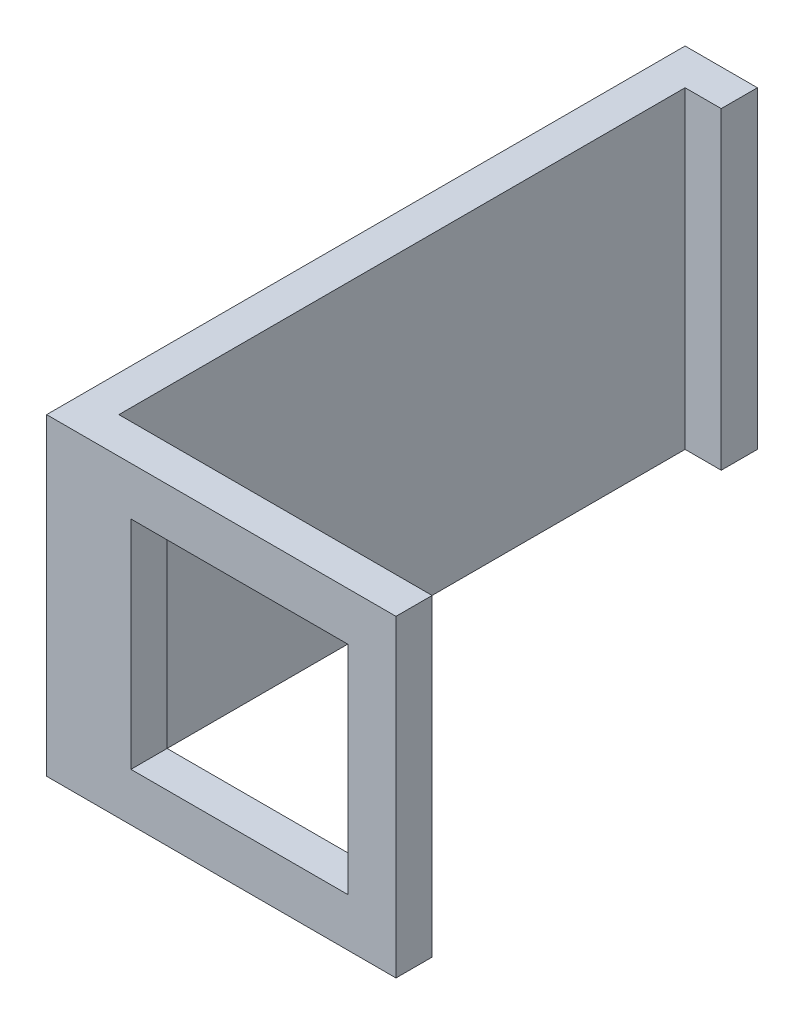
ISO-10303-21;
HEADER;
FILE_DESCRIPTION(('STEP AP214'),'2;1');
FILE_NAME('part.step','',(''),(''),'','','');
FILE_SCHEMA(('AUTOMOTIVE_DESIGN { 1 0 10303 214 1 1 1 1 }'));
ENDSEC;
DATA;
#1=APPLICATION_CONTEXT('core data for automotive mechanical design processes');
#2=APPLICATION_PROTOCOL_DEFINITION('international standard','automotive_design',2000,#1);
#3=PRODUCT_CONTEXT('',#1,'mechanical');
#4=PRODUCT('Part','Part','',(#3));
#5=PRODUCT_RELATED_PRODUCT_CATEGORY('part','',(#4));
#6=PRODUCT_DEFINITION_FORMATION('','',#4);
#7=PRODUCT_DEFINITION_CONTEXT('part definition',#1,'design');
#8=PRODUCT_DEFINITION('design','',#6,#7);
#9=PRODUCT_DEFINITION_SHAPE('','',#8);
#10=(LENGTH_UNIT() NAMED_UNIT(*) SI_UNIT(.MILLI.,.METRE.));
#11=(NAMED_UNIT(*) PLANE_ANGLE_UNIT() SI_UNIT($,.RADIAN.));
#12=(NAMED_UNIT(*) SI_UNIT($,.STERADIAN.) SOLID_ANGLE_UNIT());
#13=UNCERTAINTY_MEASURE_WITH_UNIT(LENGTH_MEASURE(1.E-05),#10,'distance_accuracy_value','');
#14=(GEOMETRIC_REPRESENTATION_CONTEXT(3) GLOBAL_UNCERTAINTY_ASSIGNED_CONTEXT((#13)) GLOBAL_UNIT_ASSIGNED_CONTEXT((#10,
#11,#12)) REPRESENTATION_CONTEXT('',''));
#15=CARTESIAN_POINT('',(0.,0.,0.));
#16=DIRECTION('',(0.,0.,1.));
#17=DIRECTION('',(1.,0.,0.));
#18=AXIS2_PLACEMENT_3D('',#15,#16,#17);
#19=CARTESIAN_POINT('',(-5.75,6.5,-25.));
#20=DIRECTION('',(-1.,0.,0.));
#21=DIRECTION('',(0.,-1.,0.));
#22=AXIS2_PLACEMENT_3D('',#19,#20,#21);
#23=PLANE('',#22);
#24=DIRECTION('',(0.,-1.,0.));
#25=VECTOR('',#24,1.);
#26=CARTESIAN_POINT('',(-5.75,-6.5,-23.5));
#27=LINE('',#26,#25);
#28=CARTESIAN_POINT('',(-5.75,6.5,-23.5));
#29=VERTEX_POINT('',#28);
#30=CARTESIAN_POINT('',(-5.75,-6.5,-23.5));
#31=VERTEX_POINT('',#30);
#32=EDGE_CURVE('E151',#29,#31,#27,.T.);
#33=ORIENTED_EDGE('',*,*,#32,.F.);
#34=DIRECTION('',(0.,0.,1.));
#35=VECTOR('',#34,1.);
#36=CARTESIAN_POINT('',(-5.75,6.5,-25.));
#37=LINE('',#36,#35);
#38=CARTESIAN_POINT('',(-5.74999999999999,6.5,0.));
#39=VERTEX_POINT('',#38);
#40=EDGE_CURVE('E37',#29,#39,#37,.T.);
#41=ORIENTED_EDGE('',*,*,#40,.T.);
#42=DIRECTION('',(0.,-1.,0.));
#43=VECTOR('',#42,1.);
#44=CARTESIAN_POINT('',(-5.75,6.5,0.));
#45=LINE('',#44,#43);
#46=CARTESIAN_POINT('',(-5.75,-6.5,0.));
#47=VERTEX_POINT('',#46);
#48=EDGE_CURVE('E161',#39,#47,#45,.T.);
#49=ORIENTED_EDGE('',*,*,#48,.T.);
#50=DIRECTION('',(0.,0.,1.));
#51=VECTOR('',#50,1.);
#52=CARTESIAN_POINT('',(-5.75,-6.5,-25.));
#53=LINE('',#52,#51);
#54=EDGE_CURVE('E164',#31,#47,#53,.T.);
#55=ORIENTED_EDGE('',*,*,#54,.F.);
#56=EDGE_LOOP('',(#33,#41,#49,#55));
#57=FACE_BOUND('',#56,.T.);
#58=ADVANCED_FACE('F33',(#57),#23,.F.);
#59=CARTESIAN_POINT('',(0.,0.,0.));
#60=DIRECTION('',(0.,0.,1.));
#61=DIRECTION('',(1.,0.,0.));
#62=AXIS2_PLACEMENT_3D('',#59,#60,#61);
#63=PLANE('',#62);
#64=DIRECTION('',(0.,1.,0.));
#65=VECTOR('',#64,1.);
#66=CARTESIAN_POINT('',(5.25,-4.5,0.));
#67=LINE('',#66,#65);
#68=CARTESIAN_POINT('',(5.25,-4.5,0.));
#69=VERTEX_POINT('',#68);
#70=CARTESIAN_POINT('',(5.25,4.5,0.));
#71=VERTEX_POINT('',#70);
#72=EDGE_CURVE('E180',#69,#71,#67,.T.);
#73=ORIENTED_EDGE('',*,*,#72,.T.);
#74=DIRECTION('',(-1.,0.,0.));
#75=VECTOR('',#74,1.);
#76=CARTESIAN_POINT('',(5.25,4.5,0.));
#77=LINE('',#76,#75);
#78=CARTESIAN_POINT('',(-3.75,4.5,0.));
#79=VERTEX_POINT('',#78);
#80=EDGE_CURVE('E182',#71,#79,#77,.T.);
#81=ORIENTED_EDGE('',*,*,#80,.T.);
#82=DIRECTION('',(0.,-1.,0.));
#83=VECTOR('',#82,1.);
#84=CARTESIAN_POINT('',(-3.75,-4.5,0.));
#85=LINE('',#84,#83);
#86=CARTESIAN_POINT('',(-3.75,-4.5,0.));
#87=VERTEX_POINT('',#86);
#88=EDGE_CURVE('E187',#79,#87,#85,.T.);
#89=ORIENTED_EDGE('',*,*,#88,.T.);
#90=DIRECTION('',(1.,0.,0.));
#91=VECTOR('',#90,1.);
#92=CARTESIAN_POINT('',(5.25,-4.5,0.));
#93=LINE('',#92,#91);
#94=EDGE_CURVE('E195',#87,#69,#93,.T.);
#95=ORIENTED_EDGE('',*,*,#94,.T.);
#96=EDGE_LOOP('',(#73,#81,#89,#95));
#97=FACE_BOUND('',#96,.T.);
#98=ORIENTED_EDGE('',*,*,#48,.F.);
#99=DIRECTION('',(-1.,0.,0.));
#100=VECTOR('',#99,1.);
#101=CARTESIAN_POINT('',(7.25,6.5,0.));
#102=LINE('',#101,#100);
#103=CARTESIAN_POINT('',(7.25,6.5,0.));
#104=VERTEX_POINT('',#103);
#105=EDGE_CURVE('E210',#104,#39,#102,.T.);
#106=ORIENTED_EDGE('',*,*,#105,.F.);
#107=DIRECTION('',(0.,1.,0.));
#108=VECTOR('',#107,1.);
#109=CARTESIAN_POINT('',(7.25,-6.5,0.));
#110=LINE('',#109,#108);
#111=CARTESIAN_POINT('',(7.25,-6.5,0.));
#112=VERTEX_POINT('',#111);
#113=EDGE_CURVE('E218',#112,#104,#110,.T.);
#114=ORIENTED_EDGE('',*,*,#113,.F.);
#115=DIRECTION('',(1.,0.,0.));
#116=VECTOR('',#115,1.);
#117=CARTESIAN_POINT('',(7.25,-6.5,0.));
#118=LINE('',#117,#116);
#119=EDGE_CURVE('E172',#47,#112,#118,.T.);
#120=ORIENTED_EDGE('',*,*,#119,.F.);
#121=EDGE_LOOP('',(#98,#106,#114,#120));
#122=FACE_BOUND('',#121,.T.);
#123=ADVANCED_FACE('F242',(#97,#122),#63,.F.);
#124=CARTESIAN_POINT('',(0.,0.,1.5));
#125=DIRECTION('',(0.,0.,1.));
#126=DIRECTION('',(1.,0.,0.));
#127=AXIS2_PLACEMENT_3D('',#124,#125,#126);
#128=PLANE('',#127);
#129=DIRECTION('',(0.,-1.,0.));
#130=VECTOR('',#129,1.);
#131=CARTESIAN_POINT('',(-7.25,-6.5,1.5));
#132=LINE('',#131,#130);
#133=CARTESIAN_POINT('',(-7.25,6.5,1.5));
#134=VERTEX_POINT('',#133);
#135=CARTESIAN_POINT('',(-7.25,-6.5,1.5));
#136=VERTEX_POINT('',#135);
#137=EDGE_CURVE('E206',#134,#136,#132,.T.);
#138=ORIENTED_EDGE('',*,*,#137,.T.);
#139=DIRECTION('',(1.,0.,0.));
#140=VECTOR('',#139,1.);
#141=CARTESIAN_POINT('',(7.25,-6.5,1.5));
#142=LINE('',#141,#140);
#143=CARTESIAN_POINT('',(7.25,-6.5,1.5));
#144=VERTEX_POINT('',#143);
#145=EDGE_CURVE('E209',#136,#144,#142,.T.);
#146=ORIENTED_EDGE('',*,*,#145,.T.);
#147=DIRECTION('',(0.,1.,0.));
#148=VECTOR('',#147,1.);
#149=CARTESIAN_POINT('',(7.25,-6.5,1.5));
#150=LINE('',#149,#148);
#151=CARTESIAN_POINT('',(7.25,6.5,1.5));
#152=VERTEX_POINT('',#151);
#153=EDGE_CURVE('E212',#144,#152,#150,.T.);
#154=ORIENTED_EDGE('',*,*,#153,.T.);
#155=DIRECTION('',(-1.,0.,0.));
#156=VECTOR('',#155,1.);
#157=CARTESIAN_POINT('',(7.25,6.5,1.5));
#158=LINE('',#157,#156);
#159=EDGE_CURVE('E214',#152,#134,#158,.T.);
#160=ORIENTED_EDGE('',*,*,#159,.T.);
#161=EDGE_LOOP('',(#138,#146,#154,#160));
#162=FACE_BOUND('',#161,.T.);
#163=DIRECTION('',(-1.,0.,0.));
#164=VECTOR('',#163,1.);
#165=CARTESIAN_POINT('',(5.25,4.5,1.5));
#166=LINE('',#165,#164);
#167=CARTESIAN_POINT('',(5.25,4.5,1.5));
#168=VERTEX_POINT('',#167);
#169=CARTESIAN_POINT('',(-3.75,4.5,1.5));
#170=VERTEX_POINT('',#169);
#171=EDGE_CURVE('E391',#168,#170,#166,.T.);
#172=ORIENTED_EDGE('',*,*,#171,.F.);
#173=DIRECTION('',(0.,1.,0.));
#174=VECTOR('',#173,1.);
#175=CARTESIAN_POINT('',(5.25,-4.5,1.5));
#176=LINE('',#175,#174);
#177=CARTESIAN_POINT('',(5.25,-4.5,1.5));
#178=VERTEX_POINT('',#177);
#179=EDGE_CURVE('E167',#178,#168,#176,.T.);
#180=ORIENTED_EDGE('',*,*,#179,.F.);
#181=DIRECTION('',(1.,0.,0.));
#182=VECTOR('',#181,1.);
#183=CARTESIAN_POINT('',(5.25,-4.5,1.5));
#184=LINE('',#183,#182);
#185=CARTESIAN_POINT('',(-3.75,-4.5,1.5));
#186=VERTEX_POINT('',#185);
#187=EDGE_CURVE('E190',#186,#178,#184,.T.);
#188=ORIENTED_EDGE('',*,*,#187,.F.);
#189=DIRECTION('',(0.,-1.,0.));
#190=VECTOR('',#189,1.);
#191=CARTESIAN_POINT('',(-3.75,-4.5,1.5));
#192=LINE('',#191,#190);
#193=EDGE_CURVE('E389',#170,#186,#192,.T.);
#194=ORIENTED_EDGE('',*,*,#193,.F.);
#195=EDGE_LOOP('',(#172,#180,#188,#194));
#196=FACE_BOUND('',#195,.T.);
#197=ADVANCED_FACE('F234',(#162,#196),#128,.T.);
#198=CARTESIAN_POINT('',(-7.25,-6.5,1.5));
#199=DIRECTION('',(1.,0.,0.));
#200=DIRECTION('',(0.,0.,-1.));
#201=AXIS2_PLACEMENT_3D('',#198,#199,#200);
#202=PLANE('',#201);
#203=DIRECTION('',(0.,0.,-1.));
#204=VECTOR('',#203,1.);
#205=CARTESIAN_POINT('',(-7.25,6.5,1.5));
#206=LINE('',#205,#204);
#207=CARTESIAN_POINT('',(-7.25,6.5,-25.));
#208=VERTEX_POINT('',#207);
#209=EDGE_CURVE('E215',#134,#208,#206,.T.);
#210=ORIENTED_EDGE('',*,*,#209,.T.);
#211=DIRECTION('',(0.,1.,0.));
#212=VECTOR('',#211,1.);
#213=CARTESIAN_POINT('',(-7.25,6.5,-25.));
#214=LINE('',#213,#212);
#215=CARTESIAN_POINT('',(-7.25,-6.5,-25.));
#216=VERTEX_POINT('',#215);
#217=EDGE_CURVE('E133',#216,#208,#214,.T.);
#218=ORIENTED_EDGE('',*,*,#217,.F.);
#219=DIRECTION('',(0.,0.,-1.));
#220=VECTOR('',#219,1.);
#221=CARTESIAN_POINT('',(-7.25,-6.5,1.5));
#222=LINE('',#221,#220);
#223=EDGE_CURVE('E11',#136,#216,#222,.T.);
#224=ORIENTED_EDGE('',*,*,#223,.F.);
#225=ORIENTED_EDGE('',*,*,#137,.F.);
#226=EDGE_LOOP('',(#210,#218,#224,#225));
#227=FACE_BOUND('',#226,.T.);
#228=ADVANCED_FACE('F35',(#227),#202,.F.);
#229=CARTESIAN_POINT('',(7.25,-6.5,1.5));
#230=DIRECTION('',(0.,1.,0.));
#231=DIRECTION('',(-1.,0.,0.));
#232=AXIS2_PLACEMENT_3D('',#229,#230,#231);
#233=PLANE('',#232);
#234=ORIENTED_EDGE('',*,*,#223,.T.);
#235=DIRECTION('',(-1.,0.,0.));
#236=VECTOR('',#235,1.);
#237=CARTESIAN_POINT('',(-5.75,-6.5,-25.));
#238=LINE('',#237,#236);
#239=CARTESIAN_POINT('',(-4.25,-6.5,-25.));
#240=VERTEX_POINT('',#239);
#241=EDGE_CURVE('E136',#240,#216,#238,.T.);
#242=ORIENTED_EDGE('',*,*,#241,.F.);
#243=DIRECTION('',(0.,0.,-1.));
#244=VECTOR('',#243,1.);
#245=CARTESIAN_POINT('',(-4.25,-6.5,-23.5));
#246=LINE('',#245,#244);
#247=CARTESIAN_POINT('',(-4.25,-6.5,-23.5));
#248=VERTEX_POINT('',#247);
#249=EDGE_CURVE('E150',#248,#240,#246,.T.);
#250=ORIENTED_EDGE('',*,*,#249,.F.);
#251=DIRECTION('',(-1.,0.,0.));
#252=VECTOR('',#251,1.);
#253=CARTESIAN_POINT('',(-4.25,-6.5,-23.5));
#254=LINE('',#253,#252);
#255=EDGE_CURVE('E156',#248,#31,#254,.T.);
#256=ORIENTED_EDGE('',*,*,#255,.T.);
#257=ORIENTED_EDGE('',*,*,#54,.T.);
#258=ORIENTED_EDGE('',*,*,#119,.T.);
#259=DIRECTION('',(0.,0.,-1.));
#260=VECTOR('',#259,1.);
#261=CARTESIAN_POINT('',(7.25,-6.5,1.5));
#262=LINE('',#261,#260);
#263=EDGE_CURVE('E43',#144,#112,#262,.T.);
#264=ORIENTED_EDGE('',*,*,#263,.F.);
#265=ORIENTED_EDGE('',*,*,#145,.F.);
#266=EDGE_LOOP('',(#234,#242,#250,#256,#257,#258,#264,#265));
#267=FACE_BOUND('',#266,.T.);
#268=ADVANCED_FACE('F246',(#267),#233,.F.);
#269=CARTESIAN_POINT('',(7.25,-6.5,1.5));
#270=DIRECTION('',(-1.,0.,0.));
#271=DIRECTION('',(0.,0.,1.));
#272=AXIS2_PLACEMENT_3D('',#269,#270,#271);
#273=PLANE('',#272);
#274=ORIENTED_EDGE('',*,*,#113,.T.);
#275=DIRECTION('',(0.,0.,-1.));
#276=VECTOR('',#275,1.);
#277=CARTESIAN_POINT('',(7.25,6.5,1.5));
#278=LINE('',#277,#276);
#279=EDGE_CURVE('E225',#152,#104,#278,.T.);
#280=ORIENTED_EDGE('',*,*,#279,.F.);
#281=ORIENTED_EDGE('',*,*,#153,.F.);
#282=ORIENTED_EDGE('',*,*,#263,.T.);
#283=EDGE_LOOP('',(#274,#280,#281,#282));
#284=FACE_BOUND('',#283,.T.);
#285=ADVANCED_FACE('F239',(#284),#273,.F.);
#286=CARTESIAN_POINT('',(7.25,6.5,1.5));
#287=DIRECTION('',(0.,-1.,0.));
#288=DIRECTION('',(1.,0.,0.));
#289=AXIS2_PLACEMENT_3D('',#286,#287,#288);
#290=PLANE('',#289);
#291=ORIENTED_EDGE('',*,*,#105,.T.);
#292=ORIENTED_EDGE('',*,*,#40,.F.);
#293=DIRECTION('',(-1.,0.,0.));
#294=VECTOR('',#293,1.);
#295=CARTESIAN_POINT('',(-4.25,6.5,-23.5));
#296=LINE('',#295,#294);
#297=CARTESIAN_POINT('',(-4.25,6.5,-23.5));
#298=VERTEX_POINT('',#297);
#299=EDGE_CURVE('E142',#298,#29,#296,.T.);
#300=ORIENTED_EDGE('',*,*,#299,.F.);
#301=DIRECTION('',(0.,0.,1.));
#302=VECTOR('',#301,1.);
#303=CARTESIAN_POINT('',(-4.25,6.5,-23.5));
#304=LINE('',#303,#302);
#305=CARTESIAN_POINT('',(-4.25,6.5,-25.));
#306=VERTEX_POINT('',#305);
#307=EDGE_CURVE('E139',#306,#298,#304,.T.);
#308=ORIENTED_EDGE('',*,*,#307,.F.);
#309=DIRECTION('',(1.,0.,0.));
#310=VECTOR('',#309,1.);
#311=CARTESIAN_POINT('',(-5.75,6.5,-25.));
#312=LINE('',#311,#310);
#313=EDGE_CURVE('E126',#208,#306,#312,.T.);
#314=ORIENTED_EDGE('',*,*,#313,.F.);
#315=ORIENTED_EDGE('',*,*,#209,.F.);
#316=ORIENTED_EDGE('',*,*,#159,.F.);
#317=ORIENTED_EDGE('',*,*,#279,.T.);
#318=EDGE_LOOP('',(#291,#292,#300,#308,#314,#315,#316,#317));
#319=FACE_BOUND('',#318,.T.);
#320=ADVANCED_FACE('F141',(#319),#290,.F.);
#321=CARTESIAN_POINT('',(5.25,-4.5,1.5));
#322=DIRECTION('',(-1.,0.,0.));
#323=DIRECTION('',(0.,0.,1.));
#324=AXIS2_PLACEMENT_3D('',#321,#322,#323);
#325=PLANE('',#324);
#326=ORIENTED_EDGE('',*,*,#72,.F.);
#327=DIRECTION('',(0.,0.,-1.));
#328=VECTOR('',#327,1.);
#329=CARTESIAN_POINT('',(5.25,-4.5,1.5));
#330=LINE('',#329,#328);
#331=EDGE_CURVE('E197',#178,#69,#330,.T.);
#332=ORIENTED_EDGE('',*,*,#331,.F.);
#333=ORIENTED_EDGE('',*,*,#179,.T.);
#334=DIRECTION('',(0.,0.,-1.));
#335=VECTOR('',#334,1.);
#336=CARTESIAN_POINT('',(5.25,4.5,1.5));
#337=LINE('',#336,#335);
#338=EDGE_CURVE('E203',#168,#71,#337,.T.);
#339=ORIENTED_EDGE('',*,*,#338,.T.);
#340=EDGE_LOOP('',(#326,#332,#333,#339));
#341=FACE_BOUND('',#340,.T.);
#342=ADVANCED_FACE('F272',(#341),#325,.T.);
#343=CARTESIAN_POINT('',(5.25,4.5,1.5));
#344=DIRECTION('',(0.,-1.,0.));
#345=DIRECTION('',(1.,0.,0.));
#346=AXIS2_PLACEMENT_3D('',#343,#344,#345);
#347=PLANE('',#346);
#348=ORIENTED_EDGE('',*,*,#80,.F.);
#349=ORIENTED_EDGE('',*,*,#338,.F.);
#350=ORIENTED_EDGE('',*,*,#171,.T.);
#351=DIRECTION('',(0.,0.,-1.));
#352=VECTOR('',#351,1.);
#353=CARTESIAN_POINT('',(-3.75,4.5,1.5));
#354=LINE('',#353,#352);
#355=EDGE_CURVE('E201',#170,#79,#354,.T.);
#356=ORIENTED_EDGE('',*,*,#355,.T.);
#357=EDGE_LOOP('',(#348,#349,#350,#356));
#358=FACE_BOUND('',#357,.T.);
#359=ADVANCED_FACE('F268',(#358),#347,.T.);
#360=CARTESIAN_POINT('',(-3.75,-4.5,1.5));
#361=DIRECTION('',(1.,0.,0.));
#362=DIRECTION('',(0.,1.,0.));
#363=AXIS2_PLACEMENT_3D('',#360,#361,#362);
#364=PLANE('',#363);
#365=ORIENTED_EDGE('',*,*,#88,.F.);
#366=ORIENTED_EDGE('',*,*,#355,.F.);
#367=ORIENTED_EDGE('',*,*,#193,.T.);
#368=DIRECTION('',(0.,0.,-1.));
#369=VECTOR('',#368,1.);
#370=CARTESIAN_POINT('',(-3.75,-4.5,1.5));
#371=LINE('',#370,#369);
#372=EDGE_CURVE('E58',#186,#87,#371,.T.);
#373=ORIENTED_EDGE('',*,*,#372,.T.);
#374=EDGE_LOOP('',(#365,#366,#367,#373));
#375=FACE_BOUND('',#374,.T.);
#376=ADVANCED_FACE('F265',(#375),#364,.T.);
#377=CARTESIAN_POINT('',(5.25,-4.5,1.5));
#378=DIRECTION('',(0.,1.,0.));
#379=DIRECTION('',(0.,0.,1.));
#380=AXIS2_PLACEMENT_3D('',#377,#378,#379);
#381=PLANE('',#380);
#382=ORIENTED_EDGE('',*,*,#94,.F.);
#383=ORIENTED_EDGE('',*,*,#372,.F.);
#384=ORIENTED_EDGE('',*,*,#187,.T.);
#385=ORIENTED_EDGE('',*,*,#331,.T.);
#386=EDGE_LOOP('',(#382,#383,#384,#385));
#387=FACE_BOUND('',#386,.T.);
#388=ADVANCED_FACE('F262',(#387),#381,.T.);
#389=CARTESIAN_POINT('',(0.,0.,-25.));
#390=DIRECTION('',(0.,0.,-1.));
#391=DIRECTION('',(-1.,0.,0.));
#392=AXIS2_PLACEMENT_3D('',#389,#390,#391);
#393=PLANE('',#392);
#394=ORIENTED_EDGE('',*,*,#217,.T.);
#395=ORIENTED_EDGE('',*,*,#313,.T.);
#396=DIRECTION('',(0.,1.,0.));
#397=VECTOR('',#396,1.);
#398=CARTESIAN_POINT('',(-4.25,-6.5,-25.));
#399=LINE('',#398,#397);
#400=EDGE_CURVE('E131',#240,#306,#399,.T.);
#401=ORIENTED_EDGE('',*,*,#400,.F.);
#402=ORIENTED_EDGE('',*,*,#241,.T.);
#403=EDGE_LOOP('',(#394,#395,#401,#402));
#404=FACE_BOUND('',#403,.T.);
#405=ADVANCED_FACE('F128',(#404),#393,.T.);
#406=CARTESIAN_POINT('',(-4.25,-6.5,-23.5));
#407=DIRECTION('',(0.,0.,-1.));
#408=DIRECTION('',(-1.,0.,0.));
#409=AXIS2_PLACEMENT_3D('',#406,#407,#408);
#410=PLANE('',#409);
#411=ORIENTED_EDGE('',*,*,#32,.T.);
#412=ORIENTED_EDGE('',*,*,#255,.F.);
#413=DIRECTION('',(0.,-1.,0.));
#414=VECTOR('',#413,1.);
#415=CARTESIAN_POINT('',(-4.25,-6.5,-23.5));
#416=LINE('',#415,#414);
#417=EDGE_CURVE('E145',#298,#248,#416,.T.);
#418=ORIENTED_EDGE('',*,*,#417,.F.);
#419=ORIENTED_EDGE('',*,*,#299,.T.);
#420=EDGE_LOOP('',(#411,#412,#418,#419));
#421=FACE_BOUND('',#420,.T.);
#422=ADVANCED_FACE('F245',(#421),#410,.F.);
#423=CARTESIAN_POINT('',(-4.25,0.,0.));
#424=DIRECTION('',(-1.,0.,0.));
#425=DIRECTION('',(0.,-1.,0.));
#426=AXIS2_PLACEMENT_3D('',#423,#424,#425);
#427=PLANE('',#426);
#428=ORIENTED_EDGE('',*,*,#400,.T.);
#429=ORIENTED_EDGE('',*,*,#307,.T.);
#430=ORIENTED_EDGE('',*,*,#417,.T.);
#431=ORIENTED_EDGE('',*,*,#249,.T.);
#432=EDGE_LOOP('',(#428,#429,#430,#431));
#433=FACE_BOUND('',#432,.T.);
#434=ADVANCED_FACE('F148',(#433),#427,.F.);
#435=CLOSED_SHELL('',(#58,#123,#197,#228,#268,#285,#320,#342,#359,#376,#388,#405,#422,#434));
#436=MANIFOLD_SOLID_BREP('B2',#435);
#437=ADVANCED_BREP_SHAPE_REPRESENTATION('',(#18,#436),#14);
#438=SHAPE_DEFINITION_REPRESENTATION(#9,#437);
ENDSEC;
END-ISO-10303-21;
